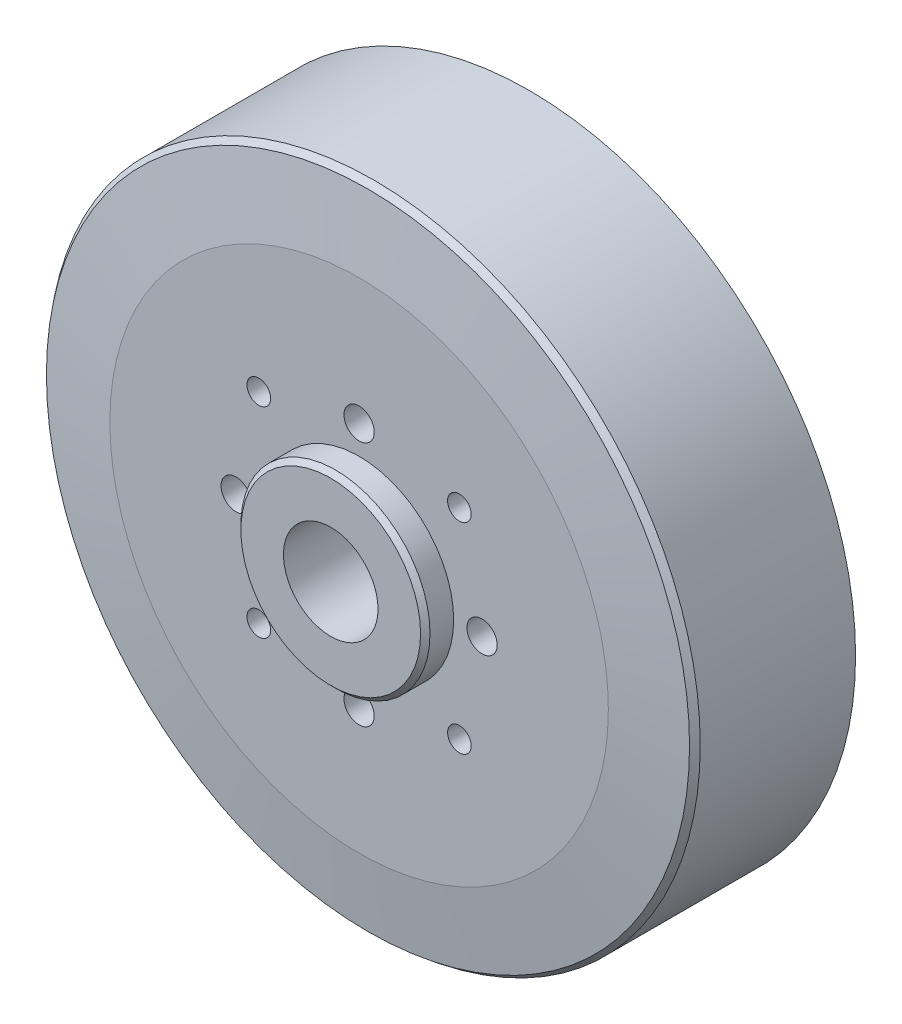
ISO-10303-21;
HEADER;
FILE_DESCRIPTION(('STEP AP214'),'2;1');
FILE_NAME('part.step','',(''),(''),'','','');
FILE_SCHEMA(('AUTOMOTIVE_DESIGN { 1 0 10303 214 1 1 1 1 }'));
ENDSEC;
DATA;
#1=APPLICATION_CONTEXT('core data for automotive mechanical design processes');
#2=APPLICATION_PROTOCOL_DEFINITION('international standard','automotive_design',2000,#1);
#3=PRODUCT_CONTEXT('',#1,'mechanical');
#4=PRODUCT('Part','Part','',(#3));
#5=PRODUCT_RELATED_PRODUCT_CATEGORY('part','',(#4));
#6=PRODUCT_DEFINITION_FORMATION('','',#4);
#7=PRODUCT_DEFINITION_CONTEXT('part definition',#1,'design');
#8=PRODUCT_DEFINITION('design','',#6,#7);
#9=PRODUCT_DEFINITION_SHAPE('','',#8);
#10=(LENGTH_UNIT() NAMED_UNIT(*) SI_UNIT(.MILLI.,.METRE.));
#11=(NAMED_UNIT(*) PLANE_ANGLE_UNIT() SI_UNIT($,.RADIAN.));
#12=(NAMED_UNIT(*) SI_UNIT($,.STERADIAN.) SOLID_ANGLE_UNIT());
#13=UNCERTAINTY_MEASURE_WITH_UNIT(LENGTH_MEASURE(1.E-05),#10,'distance_accuracy_value','');
#14=(GEOMETRIC_REPRESENTATION_CONTEXT(3) GLOBAL_UNCERTAINTY_ASSIGNED_CONTEXT((#13)) GLOBAL_UNIT_ASSIGNED_CONTEXT((#10,
#11,#12)) REPRESENTATION_CONTEXT('',''));
#15=CARTESIAN_POINT('',(0.,0.,0.));
#16=DIRECTION('',(0.,0.,1.));
#17=DIRECTION('',(1.,0.,0.));
#18=AXIS2_PLACEMENT_3D('',#15,#16,#17);
#19=CARTESIAN_POINT('',(0.,0.,-14.1421356237309));
#20=DIRECTION('',(0.,0.,1.));
#21=DIRECTION('',(1.,0.,0.));
#22=AXIS2_PLACEMENT_3D('',#19,#20,#21);
#23=CYLINDRICAL_SURFACE('',#22,5.);
#24=CARTESIAN_POINT('',(0.,0.,21.));
#25=DIRECTION('',(0.,0.,1.));
#26=DIRECTION('',(1.,0.,0.));
#27=AXIS2_PLACEMENT_3D('',#24,#25,#26);
#28=CIRCLE('',#27,5.);
#29=CARTESIAN_POINT('',(5.,0.,21.));
#30=VERTEX_POINT('',#29);
#31=EDGE_CURVE('E113',#30,#30,#28,.T.);
#32=ORIENTED_EDGE('',*,*,#31,.T.);
#33=EDGE_LOOP('',(#32));
#34=FACE_BOUND('',#33,.T.);
#35=CARTESIAN_POINT('',(0.,0.,11.));
#36=DIRECTION('',(0.,0.,-1.));
#37=DIRECTION('',(-1.,0.,0.));
#38=AXIS2_PLACEMENT_3D('',#35,#36,#37);
#39=CIRCLE('',#38,5.);
#40=CARTESIAN_POINT('',(-5.,0.,11.));
#41=VERTEX_POINT('',#40);
#42=EDGE_CURVE('E109',#41,#41,#39,.F.);
#43=ORIENTED_EDGE('',*,*,#42,.F.);
#44=EDGE_LOOP('',(#43));
#45=FACE_BOUND('',#44,.T.);
#46=ADVANCED_FACE('F43',(#34,#45),#23,.F.);
#47=CARTESIAN_POINT('',(0.,0.,18.));
#48=DIRECTION('',(0.,0.,-1.));
#49=DIRECTION('',(-1.,0.,0.));
#50=AXIS2_PLACEMENT_3D('',#47,#48,#49);
#51=CYLINDRICAL_SURFACE('',#50,34.5);
#52=CARTESIAN_POINT('',(0.,0.,16.4257341010232));
#53=DIRECTION('',(0.,0.,1.));
#54=DIRECTION('',(1.,0.,0.));
#55=AXIS2_PLACEMENT_3D('',#52,#53,#54);
#56=CIRCLE('',#55,34.5);
#57=CARTESIAN_POINT('',(34.5,0.,16.4257341010232));
#58=VERTEX_POINT('',#57);
#59=EDGE_CURVE('E61',#58,#58,#56,.F.);
#60=ORIENTED_EDGE('',*,*,#59,.T.);
#61=EDGE_LOOP('',(#60));
#62=FACE_BOUND('',#61,.T.);
#63=CARTESIAN_POINT('',(0.,0.,0.));
#64=DIRECTION('',(0.,0.,1.));
#65=DIRECTION('',(1.,0.,0.));
#66=AXIS2_PLACEMENT_3D('',#63,#64,#65);
#67=CIRCLE('',#66,34.5);
#68=CARTESIAN_POINT('',(34.5,0.,0.));
#69=VERTEX_POINT('',#68);
#70=EDGE_CURVE('E119',#69,#69,#67,.T.);
#71=ORIENTED_EDGE('',*,*,#70,.T.);
#72=EDGE_LOOP('',(#71));
#73=FACE_BOUND('',#72,.T.);
#74=ADVANCED_FACE('F230',(#62,#73),#51,.T.);
#75=CARTESIAN_POINT('',(0.,0.,18.));
#76=DIRECTION('',(0.,0.,1.));
#77=DIRECTION('',(1.,0.,0.));
#78=AXIS2_PLACEMENT_3D('',#75,#76,#77);
#79=PLANE('',#78);
#80=CARTESIAN_POINT('',(13.,0.,18.));
#81=DIRECTION('',(0.,0.,1.));
#82=DIRECTION('',(1.,0.,0.));
#83=AXIS2_PLACEMENT_3D('',#80,#81,#82);
#84=CIRCLE('',#83,1.59999999999999);
#85=CARTESIAN_POINT('',(14.6,0.,18.));
#86=VERTEX_POINT('',#85);
#87=EDGE_CURVE('E73',#86,#86,#84,.T.);
#88=ORIENTED_EDGE('',*,*,#87,.F.);
#89=EDGE_LOOP('',(#88));
#90=FACE_BOUND('',#89,.T.);
#91=CARTESIAN_POINT('',(-13.,0.,18.));
#92=DIRECTION('',(0.,0.,1.));
#93=DIRECTION('',(1.,0.,0.));
#94=AXIS2_PLACEMENT_3D('',#91,#92,#93);
#95=CIRCLE('',#94,1.59999999999999);
#96=CARTESIAN_POINT('',(-11.4,0.,18.));
#97=VERTEX_POINT('',#96);
#98=EDGE_CURVE('E72',#97,#97,#95,.T.);
#99=ORIENTED_EDGE('',*,*,#98,.F.);
#100=EDGE_LOOP('',(#99));
#101=FACE_BOUND('',#100,.T.);
#102=CARTESIAN_POINT('',(0.,13.,18.));
#103=DIRECTION('',(0.,0.,1.));
#104=DIRECTION('',(1.,0.,0.));
#105=AXIS2_PLACEMENT_3D('',#102,#103,#104);
#106=CIRCLE('',#105,1.59999999999999);
#107=CARTESIAN_POINT('',(1.59999999999999,13.,18.));
#108=VERTEX_POINT('',#107);
#109=EDGE_CURVE('E78',#108,#108,#106,.T.);
#110=ORIENTED_EDGE('',*,*,#109,.F.);
#111=EDGE_LOOP('',(#110));
#112=FACE_BOUND('',#111,.T.);
#113=CARTESIAN_POINT('',(0.,-13.,18.));
#114=DIRECTION('',(0.,0.,1.));
#115=DIRECTION('',(1.,0.,0.));
#116=AXIS2_PLACEMENT_3D('',#113,#114,#115);
#117=CIRCLE('',#116,1.59999999999999);
#118=CARTESIAN_POINT('',(1.59999999999997,-13.,18.));
#119=VERTEX_POINT('',#118);
#120=EDGE_CURVE('E83',#119,#119,#117,.T.);
#121=ORIENTED_EDGE('',*,*,#120,.F.);
#122=EDGE_LOOP('',(#121));
#123=FACE_BOUND('',#122,.T.);
#124=CARTESIAN_POINT('',(10.6066017177982,10.6066017177982,18.));
#125=DIRECTION('',(0.,0.,1.));
#126=DIRECTION('',(1.,0.,0.));
#127=AXIS2_PLACEMENT_3D('',#124,#125,#126);
#128=CIRCLE('',#127,1.25);
#129=CARTESIAN_POINT('',(11.8566017177982,10.6066017177982,18.));
#130=VERTEX_POINT('',#129);
#131=EDGE_CURVE('E88',#130,#130,#128,.T.);
#132=ORIENTED_EDGE('',*,*,#131,.F.);
#133=EDGE_LOOP('',(#132));
#134=FACE_BOUND('',#133,.T.);
#135=CARTESIAN_POINT('',(10.6066017177982,-10.6066017177982,18.));
#136=DIRECTION('',(0.,0.,1.));
#137=DIRECTION('',(1.,0.,0.));
#138=AXIS2_PLACEMENT_3D('',#135,#136,#137);
#139=CIRCLE('',#138,1.25);
#140=CARTESIAN_POINT('',(11.8566017177982,-10.6066017177982,18.));
#141=VERTEX_POINT('',#140);
#142=EDGE_CURVE('E93',#141,#141,#139,.T.);
#143=ORIENTED_EDGE('',*,*,#142,.F.);
#144=EDGE_LOOP('',(#143));
#145=FACE_BOUND('',#144,.T.);
#146=CARTESIAN_POINT('',(-10.6066017177982,-10.6066017177982,18.));
#147=DIRECTION('',(0.,0.,1.));
#148=DIRECTION('',(1.,0.,0.));
#149=AXIS2_PLACEMENT_3D('',#146,#147,#148);
#150=CIRCLE('',#149,1.25);
#151=CARTESIAN_POINT('',(-9.35660171779823,-10.6066017177982,18.));
#152=VERTEX_POINT('',#151);
#153=EDGE_CURVE('E98',#152,#152,#150,.T.);
#154=ORIENTED_EDGE('',*,*,#153,.F.);
#155=EDGE_LOOP('',(#154));
#156=FACE_BOUND('',#155,.T.);
#157=CARTESIAN_POINT('',(-10.6066017177982,10.6066017177982,18.));
#158=DIRECTION('',(0.,0.,1.));
#159=DIRECTION('',(1.,0.,0.));
#160=AXIS2_PLACEMENT_3D('',#157,#158,#159);
#161=CIRCLE('',#160,1.25);
#162=CARTESIAN_POINT('',(-9.35660171779821,10.6066017177982,18.));
#163=VERTEX_POINT('',#162);
#164=EDGE_CURVE('E103',#163,#163,#161,.T.);
#165=ORIENTED_EDGE('',*,*,#164,.F.);
#166=EDGE_LOOP('',(#165));
#167=FACE_BOUND('',#166,.T.);
#168=CARTESIAN_POINT('',(0.,0.,18.));
#169=DIRECTION('',(0.,0.,1.));
#170=DIRECTION('',(1.,0.,0.));
#171=AXIS2_PLACEMENT_3D('',#168,#169,#170);
#172=CIRCLE('',#171,26.3556535720257);
#173=CARTESIAN_POINT('',(26.3556535720257,0.,18.));
#174=VERTEX_POINT('',#173);
#175=EDGE_CURVE('E67',#174,#174,#172,.T.);
#176=ORIENTED_EDGE('',*,*,#175,.T.);
#177=EDGE_LOOP('',(#176));
#178=FACE_BOUND('',#177,.T.);
#179=CARTESIAN_POINT('',(0.,0.,18.));
#180=DIRECTION('',(0.,0.,1.));
#181=DIRECTION('',(1.,0.,0.));
#182=AXIS2_PLACEMENT_3D('',#179,#180,#181);
#183=CIRCLE('',#182,10.);
#184=CARTESIAN_POINT('',(10.,0.,18.));
#185=VERTEX_POINT('',#184);
#186=EDGE_CURVE('E118',#185,#185,#183,.T.);
#187=ORIENTED_EDGE('',*,*,#186,.F.);
#188=EDGE_LOOP('',(#187));
#189=FACE_BOUND('',#188,.T.);
#190=ADVANCED_FACE('F226',(#90,#101,#112,#123,#134,#145,#156,#167,#178,#189),#79,.T.);
#191=CARTESIAN_POINT('',(0.,0.,0.));
#192=DIRECTION('',(0.,0.,1.));
#193=DIRECTION('',(1.,0.,0.));
#194=AXIS2_PLACEMENT_3D('',#191,#192,#193);
#195=PLANE('',#194);
#196=CARTESIAN_POINT('',(0.,0.,0.));
#197=DIRECTION('',(0.,0.,-1.));
#198=DIRECTION('',(-1.,0.,0.));
#199=AXIS2_PLACEMENT_3D('',#196,#197,#198);
#200=CIRCLE('',#199,30.);
#201=CARTESIAN_POINT('',(-30.,0.,0.));
#202=VERTEX_POINT('',#201);
#203=EDGE_CURVE('E108',#202,#202,#200,.T.);
#204=ORIENTED_EDGE('',*,*,#203,.F.);
#205=EDGE_LOOP('',(#204));
#206=FACE_BOUND('',#205,.T.);
#207=ORIENTED_EDGE('',*,*,#70,.F.);
#208=EDGE_LOOP('',(#207));
#209=FACE_BOUND('',#208,.T.);
#210=ADVANCED_FACE('F222',(#206,#209),#195,.F.);
#211=CARTESIAN_POINT('',(0.,0.,21.));
#212=DIRECTION('',(0.,0.,-1.));
#213=DIRECTION('',(-1.,0.,0.));
#214=AXIS2_PLACEMENT_3D('',#211,#212,#213);
#215=CYLINDRICAL_SURFACE('',#214,10.);
#216=CARTESIAN_POINT('',(0.,0.,20.5));
#217=DIRECTION('',(0.,0.,1.));
#218=DIRECTION('',(1.,0.,0.));
#219=AXIS2_PLACEMENT_3D('',#216,#217,#218);
#220=CIRCLE('',#219,10.);
#221=CARTESIAN_POINT('',(10.,0.,20.5));
#222=VERTEX_POINT('',#221);
#223=EDGE_CURVE('E11',#222,#222,#220,.F.);
#224=ORIENTED_EDGE('',*,*,#223,.T.);
#225=EDGE_LOOP('',(#224));
#226=FACE_BOUND('',#225,.T.);
#227=ORIENTED_EDGE('',*,*,#186,.T.);
#228=EDGE_LOOP('',(#227));
#229=FACE_BOUND('',#228,.T.);
#230=ADVANCED_FACE('F225',(#226,#229),#215,.T.);
#231=CARTESIAN_POINT('',(0.,0.,21.));
#232=DIRECTION('',(0.,0.,1.));
#233=DIRECTION('',(1.,0.,0.));
#234=AXIS2_PLACEMENT_3D('',#231,#232,#233);
#235=PLANE('',#234);
#236=CARTESIAN_POINT('',(0.,0.,21.));
#237=DIRECTION('',(0.,0.,1.));
#238=DIRECTION('',(1.,0.,0.));
#239=AXIS2_PLACEMENT_3D('',#236,#237,#238);
#240=CIRCLE('',#239,9.50000000000001);
#241=CARTESIAN_POINT('',(9.50000000000001,0.,21.));
#242=VERTEX_POINT('',#241);
#243=EDGE_CURVE('E51',#242,#242,#240,.T.);
#244=ORIENTED_EDGE('',*,*,#243,.T.);
#245=EDGE_LOOP('',(#244));
#246=FACE_BOUND('',#245,.T.);
#247=ORIENTED_EDGE('',*,*,#31,.F.);
#248=EDGE_LOOP('',(#247));
#249=FACE_BOUND('',#248,.T.);
#250=ADVANCED_FACE('F244',(#246,#249),#235,.T.);
#251=CARTESIAN_POINT('',(0.,0.,18.));
#252=DIRECTION('',(0.,0.,-1.));
#253=DIRECTION('',(-1.,0.,0.));
#254=AXIS2_PLACEMENT_3D('',#251,#252,#253);
#255=CONICAL_SURFACE('',#254,26.3556535720257,1.44862327915529);
#256=CARTESIAN_POINT('',(0.,0.,17.0609346717026));
#257=DIRECTION('',(0.,0.,-1.));
#258=DIRECTION('',(-1.,0.,0.));
#259=AXIS2_PLACEMENT_3D('',#256,#257,#258);
#260=CIRCLE('',#259,34.0037269241793);
#261=CARTESIAN_POINT('',(-34.0037269241793,0.,17.0609346717026));
#262=VERTEX_POINT('',#261);
#263=EDGE_CURVE('E56',#262,#262,#260,.F.);
#264=ORIENTED_EDGE('',*,*,#263,.T.);
#265=EDGE_LOOP('',(#264));
#266=FACE_BOUND('',#265,.T.);
#267=ORIENTED_EDGE('',*,*,#175,.F.);
#268=EDGE_LOOP('',(#267));
#269=FACE_BOUND('',#268,.T.);
#270=ADVANCED_FACE('F196',(#266,#269),#255,.T.);
#271=CARTESIAN_POINT('',(0.,0.,11.));
#272=DIRECTION('',(0.,0.,-1.));
#273=DIRECTION('',(-1.,0.,0.));
#274=AXIS2_PLACEMENT_3D('',#271,#272,#273);
#275=PLANE('',#274);
#276=CARTESIAN_POINT('',(0.,0.,11.));
#277=DIRECTION('',(0.,0.,-1.));
#278=DIRECTION('',(-1.,0.,0.));
#279=AXIS2_PLACEMENT_3D('',#276,#277,#278);
#280=CIRCLE('',#279,8.5);
#281=CARTESIAN_POINT('',(-8.5,0.,11.));
#282=VERTEX_POINT('',#281);
#283=EDGE_CURVE('E163',#282,#282,#280,.T.);
#284=ORIENTED_EDGE('',*,*,#283,.F.);
#285=EDGE_LOOP('',(#284));
#286=FACE_BOUND('',#285,.T.);
#287=CARTESIAN_POINT('',(13.,0.,11.));
#288=DIRECTION('',(0.,0.,-1.));
#289=DIRECTION('',(-1.,0.,0.));
#290=AXIS2_PLACEMENT_3D('',#287,#288,#289);
#291=CIRCLE('',#290,1.59999999999999);
#292=CARTESIAN_POINT('',(11.4,0.,11.));
#293=VERTEX_POINT('',#292);
#294=EDGE_CURVE('E68',#293,#293,#291,.T.);
#295=ORIENTED_EDGE('',*,*,#294,.F.);
#296=EDGE_LOOP('',(#295));
#297=FACE_BOUND('',#296,.T.);
#298=CARTESIAN_POINT('',(-13.,0.,11.));
#299=DIRECTION('',(0.,0.,-1.));
#300=DIRECTION('',(-1.,0.,0.));
#301=AXIS2_PLACEMENT_3D('',#298,#299,#300);
#302=CIRCLE('',#301,1.59999999999999);
#303=CARTESIAN_POINT('',(-14.6,0.,11.));
#304=VERTEX_POINT('',#303);
#305=EDGE_CURVE('E74',#304,#304,#302,.T.);
#306=ORIENTED_EDGE('',*,*,#305,.F.);
#307=EDGE_LOOP('',(#306));
#308=FACE_BOUND('',#307,.T.);
#309=CARTESIAN_POINT('',(0.,13.,11.));
#310=DIRECTION('',(0.,0.,-1.));
#311=DIRECTION('',(-1.,0.,0.));
#312=AXIS2_PLACEMENT_3D('',#309,#310,#311);
#313=CIRCLE('',#312,1.59999999999999);
#314=CARTESIAN_POINT('',(-1.59999999999999,13.,11.));
#315=VERTEX_POINT('',#314);
#316=EDGE_CURVE('E79',#315,#315,#313,.T.);
#317=ORIENTED_EDGE('',*,*,#316,.F.);
#318=EDGE_LOOP('',(#317));
#319=FACE_BOUND('',#318,.T.);
#320=CARTESIAN_POINT('',(0.,-13.,11.));
#321=DIRECTION('',(0.,0.,-1.));
#322=DIRECTION('',(-1.,0.,0.));
#323=AXIS2_PLACEMENT_3D('',#320,#321,#322);
#324=CIRCLE('',#323,1.59999999999999);
#325=CARTESIAN_POINT('',(-1.60000000000001,-13.,11.));
#326=VERTEX_POINT('',#325);
#327=EDGE_CURVE('E84',#326,#326,#324,.T.);
#328=ORIENTED_EDGE('',*,*,#327,.F.);
#329=EDGE_LOOP('',(#328));
#330=FACE_BOUND('',#329,.T.);
#331=CARTESIAN_POINT('',(10.6066017177982,10.6066017177982,11.));
#332=DIRECTION('',(0.,0.,-1.));
#333=DIRECTION('',(-1.,0.,0.));
#334=AXIS2_PLACEMENT_3D('',#331,#332,#333);
#335=CIRCLE('',#334,1.25);
#336=CARTESIAN_POINT('',(9.35660171779821,10.6066017177982,11.));
#337=VERTEX_POINT('',#336);
#338=EDGE_CURVE('E89',#337,#337,#335,.T.);
#339=ORIENTED_EDGE('',*,*,#338,.F.);
#340=EDGE_LOOP('',(#339));
#341=FACE_BOUND('',#340,.T.);
#342=CARTESIAN_POINT('',(10.6066017177982,-10.6066017177982,11.));
#343=DIRECTION('',(0.,0.,-1.));
#344=DIRECTION('',(-1.,0.,0.));
#345=AXIS2_PLACEMENT_3D('',#342,#343,#344);
#346=CIRCLE('',#345,1.25);
#347=CARTESIAN_POINT('',(9.35660171779823,-10.6066017177982,11.));
#348=VERTEX_POINT('',#347);
#349=EDGE_CURVE('E94',#348,#348,#346,.T.);
#350=ORIENTED_EDGE('',*,*,#349,.F.);
#351=EDGE_LOOP('',(#350));
#352=FACE_BOUND('',#351,.T.);
#353=CARTESIAN_POINT('',(-10.6066017177982,-10.6066017177982,11.));
#354=DIRECTION('',(0.,0.,-1.));
#355=DIRECTION('',(-1.,0.,0.));
#356=AXIS2_PLACEMENT_3D('',#353,#354,#355);
#357=CIRCLE('',#356,1.25);
#358=CARTESIAN_POINT('',(-11.8566017177982,-10.6066017177982,11.));
#359=VERTEX_POINT('',#358);
#360=EDGE_CURVE('E99',#359,#359,#357,.T.);
#361=ORIENTED_EDGE('',*,*,#360,.F.);
#362=EDGE_LOOP('',(#361));
#363=FACE_BOUND('',#362,.T.);
#364=CARTESIAN_POINT('',(-10.6066017177982,10.6066017177982,11.));
#365=DIRECTION('',(0.,0.,-1.));
#366=DIRECTION('',(-1.,0.,0.));
#367=AXIS2_PLACEMENT_3D('',#364,#365,#366);
#368=CIRCLE('',#367,1.25);
#369=CARTESIAN_POINT('',(-11.8566017177982,10.6066017177982,11.));
#370=VERTEX_POINT('',#369);
#371=EDGE_CURVE('E104',#370,#370,#368,.T.);
#372=ORIENTED_EDGE('',*,*,#371,.F.);
#373=EDGE_LOOP('',(#372));
#374=FACE_BOUND('',#373,.T.);
#375=CARTESIAN_POINT('',(0.,0.,11.));
#376=DIRECTION('',(0.,0.,-1.));
#377=DIRECTION('',(-1.,0.,0.));
#378=AXIS2_PLACEMENT_3D('',#375,#376,#377);
#379=CIRCLE('',#378,30.);
#380=CARTESIAN_POINT('',(-30.,0.,11.));
#381=VERTEX_POINT('',#380);
#382=EDGE_CURVE('E114',#381,#381,#379,.T.);
#383=ORIENTED_EDGE('',*,*,#382,.T.);
#384=EDGE_LOOP('',(#383));
#385=FACE_BOUND('',#384,.T.);
#386=ADVANCED_FACE('F192',(#286,#297,#308,#319,#330,#341,#352,#363,#374,#385),#275,.T.);
#387=CARTESIAN_POINT('',(0.,0.,11.));
#388=DIRECTION('',(0.,0.,-1.));
#389=DIRECTION('',(-1.,0.,0.));
#390=AXIS2_PLACEMENT_3D('',#387,#388,#389);
#391=CYLINDRICAL_SURFACE('',#390,30.);
#392=ORIENTED_EDGE('',*,*,#382,.F.);
#393=EDGE_LOOP('',(#392));
#394=FACE_BOUND('',#393,.T.);
#395=ORIENTED_EDGE('',*,*,#203,.T.);
#396=EDGE_LOOP('',(#395));
#397=FACE_BOUND('',#396,.T.);
#398=ADVANCED_FACE('F195',(#394,#397),#391,.F.);
#399=CARTESIAN_POINT('',(-10.6066017177982,10.6066017177982,18.));
#400=DIRECTION('',(0.,0.,1.));
#401=DIRECTION('',(1.,0.,0.));
#402=AXIS2_PLACEMENT_3D('',#399,#400,#401);
#403=CYLINDRICAL_SURFACE('',#402,1.25);
#404=ORIENTED_EDGE('',*,*,#371,.T.);
#405=EDGE_LOOP('',(#404));
#406=FACE_BOUND('',#405,.T.);
#407=ORIENTED_EDGE('',*,*,#164,.T.);
#408=EDGE_LOOP('',(#407));
#409=FACE_BOUND('',#408,.T.);
#410=ADVANCED_FACE('F218',(#406,#409),#403,.F.);
#411=CARTESIAN_POINT('',(-10.6066017177982,-10.6066017177982,18.));
#412=DIRECTION('',(0.,0.,1.));
#413=DIRECTION('',(1.,0.,0.));
#414=AXIS2_PLACEMENT_3D('',#411,#412,#413);
#415=CYLINDRICAL_SURFACE('',#414,1.25);
#416=ORIENTED_EDGE('',*,*,#360,.T.);
#417=EDGE_LOOP('',(#416));
#418=FACE_BOUND('',#417,.T.);
#419=ORIENTED_EDGE('',*,*,#153,.T.);
#420=EDGE_LOOP('',(#419));
#421=FACE_BOUND('',#420,.T.);
#422=ADVANCED_FACE('F276',(#418,#421),#415,.F.);
#423=CARTESIAN_POINT('',(10.6066017177982,-10.6066017177982,18.));
#424=DIRECTION('',(0.,0.,1.));
#425=DIRECTION('',(1.,0.,0.));
#426=AXIS2_PLACEMENT_3D('',#423,#424,#425);
#427=CYLINDRICAL_SURFACE('',#426,1.25);
#428=ORIENTED_EDGE('',*,*,#349,.T.);
#429=EDGE_LOOP('',(#428));
#430=FACE_BOUND('',#429,.T.);
#431=ORIENTED_EDGE('',*,*,#142,.T.);
#432=EDGE_LOOP('',(#431));
#433=FACE_BOUND('',#432,.T.);
#434=ADVANCED_FACE('F280',(#430,#433),#427,.F.);
#435=CARTESIAN_POINT('',(10.6066017177982,10.6066017177982,18.));
#436=DIRECTION('',(0.,0.,1.));
#437=DIRECTION('',(1.,0.,0.));
#438=AXIS2_PLACEMENT_3D('',#435,#436,#437);
#439=CYLINDRICAL_SURFACE('',#438,1.25);
#440=ORIENTED_EDGE('',*,*,#338,.T.);
#441=EDGE_LOOP('',(#440));
#442=FACE_BOUND('',#441,.T.);
#443=ORIENTED_EDGE('',*,*,#131,.T.);
#444=EDGE_LOOP('',(#443));
#445=FACE_BOUND('',#444,.T.);
#446=ADVANCED_FACE('F284',(#442,#445),#439,.F.);
#447=CARTESIAN_POINT('',(0.,-13.,18.));
#448=DIRECTION('',(0.,0.,1.));
#449=DIRECTION('',(1.,0.,0.));
#450=AXIS2_PLACEMENT_3D('',#447,#448,#449);
#451=CYLINDRICAL_SURFACE('',#450,1.59999999999999);
#452=ORIENTED_EDGE('',*,*,#327,.T.);
#453=EDGE_LOOP('',(#452));
#454=FACE_BOUND('',#453,.T.);
#455=ORIENTED_EDGE('',*,*,#120,.T.);
#456=EDGE_LOOP('',(#455));
#457=FACE_BOUND('',#456,.T.);
#458=ADVANCED_FACE('F288',(#454,#457),#451,.F.);
#459=CARTESIAN_POINT('',(0.,13.,18.));
#460=DIRECTION('',(0.,0.,1.));
#461=DIRECTION('',(1.,0.,0.));
#462=AXIS2_PLACEMENT_3D('',#459,#460,#461);
#463=CYLINDRICAL_SURFACE('',#462,1.59999999999999);
#464=ORIENTED_EDGE('',*,*,#316,.T.);
#465=EDGE_LOOP('',(#464));
#466=FACE_BOUND('',#465,.T.);
#467=ORIENTED_EDGE('',*,*,#109,.T.);
#468=EDGE_LOOP('',(#467));
#469=FACE_BOUND('',#468,.T.);
#470=ADVANCED_FACE('F292',(#466,#469),#463,.F.);
#471=CARTESIAN_POINT('',(-13.,0.,18.));
#472=DIRECTION('',(0.,0.,1.));
#473=DIRECTION('',(1.,0.,0.));
#474=AXIS2_PLACEMENT_3D('',#471,#472,#473);
#475=CYLINDRICAL_SURFACE('',#474,1.59999999999999);
#476=ORIENTED_EDGE('',*,*,#305,.T.);
#477=EDGE_LOOP('',(#476));
#478=FACE_BOUND('',#477,.T.);
#479=ORIENTED_EDGE('',*,*,#98,.T.);
#480=EDGE_LOOP('',(#479));
#481=FACE_BOUND('',#480,.T.);
#482=ADVANCED_FACE('F255',(#478,#481),#475,.F.);
#483=CARTESIAN_POINT('',(13.,0.,18.));
#484=DIRECTION('',(0.,0.,1.));
#485=DIRECTION('',(1.,0.,0.));
#486=AXIS2_PLACEMENT_3D('',#483,#484,#485);
#487=CYLINDRICAL_SURFACE('',#486,1.59999999999999);
#488=ORIENTED_EDGE('',*,*,#294,.T.);
#489=EDGE_LOOP('',(#488));
#490=FACE_BOUND('',#489,.T.);
#491=ORIENTED_EDGE('',*,*,#87,.T.);
#492=EDGE_LOOP('',(#491));
#493=FACE_BOUND('',#492,.T.);
#494=ADVANCED_FACE('F248',(#490,#493),#487,.F.);
#495=CARTESIAN_POINT('',(0.,0.,16.4257341010232));
#496=DIRECTION('',(0.,0.,-1.));
#497=DIRECTION('',(-1.,0.,0.));
#498=AXIS2_PLACEMENT_3D('',#495,#496,#497);
#499=CONICAL_SURFACE('',#498,34.5,0.663225115757849);
#500=ORIENTED_EDGE('',*,*,#263,.F.);
#501=EDGE_LOOP('',(#500));
#502=FACE_BOUND('',#501,.T.);
#503=ORIENTED_EDGE('',*,*,#59,.F.);
#504=EDGE_LOOP('',(#503));
#505=FACE_BOUND('',#504,.T.);
#506=ADVANCED_FACE('F246',(#502,#505),#499,.T.);
#507=CARTESIAN_POINT('',(0.,0.,21.));
#508=DIRECTION('',(0.,0.,-1.));
#509=DIRECTION('',(-1.,0.,0.));
#510=AXIS2_PLACEMENT_3D('',#507,#508,#509);
#511=CONICAL_SURFACE('',#510,9.50000000000001,0.78539816339744);
#512=ORIENTED_EDGE('',*,*,#223,.F.);
#513=EDGE_LOOP('',(#512));
#514=FACE_BOUND('',#513,.T.);
#515=ORIENTED_EDGE('',*,*,#243,.F.);
#516=EDGE_LOOP('',(#515));
#517=FACE_BOUND('',#516,.T.);
#518=ADVANCED_FACE('F45',(#514,#517),#511,.T.);
#519=CARTESIAN_POINT('',(0.,0.,-4.));
#520=DIRECTION('',(0.,0.,1.));
#521=DIRECTION('',(1.,0.,0.));
#522=AXIS2_PLACEMENT_3D('',#519,#520,#521);
#523=PLANE('',#522);
#524=CARTESIAN_POINT('',(0.,0.,-4.));
#525=DIRECTION('',(0.,0.,-1.));
#526=DIRECTION('',(-1.,0.,0.));
#527=AXIS2_PLACEMENT_3D('',#524,#525,#526);
#528=CIRCLE('',#527,3.5);
#529=CARTESIAN_POINT('',(-3.5,0.,-4.));
#530=VERTEX_POINT('',#529);
#531=EDGE_CURVE('E171',#530,#530,#528,.T.);
#532=ORIENTED_EDGE('',*,*,#531,.F.);
#533=EDGE_LOOP('',(#532));
#534=FACE_BOUND('',#533,.T.);
#535=CARTESIAN_POINT('',(0.,0.,-4.));
#536=DIRECTION('',(0.,0.,1.));
#537=DIRECTION('',(1.,0.,0.));
#538=AXIS2_PLACEMENT_3D('',#535,#536,#537);
#539=CIRCLE('',#538,8.5);
#540=CARTESIAN_POINT('',(8.5,0.,-4.));
#541=VERTEX_POINT('',#540);
#542=EDGE_CURVE('E159',#541,#541,#539,.T.);
#543=ORIENTED_EDGE('',*,*,#542,.F.);
#544=EDGE_LOOP('',(#543));
#545=FACE_BOUND('',#544,.T.);
#546=ADVANCED_FACE('F179',(#534,#545),#523,.F.);
#547=CARTESIAN_POINT('',(0.,0.,-53.0416305603426));
#548=DIRECTION('',(0.,0.,1.));
#549=DIRECTION('',(1.,0.,0.));
#550=AXIS2_PLACEMENT_3D('',#547,#548,#549);
#551=CYLINDRICAL_SURFACE('',#550,8.5);
#552=ORIENTED_EDGE('',*,*,#542,.T.);
#553=EDGE_LOOP('',(#552));
#554=FACE_BOUND('',#553,.T.);
#555=ORIENTED_EDGE('',*,*,#283,.T.);
#556=EDGE_LOOP('',(#555));
#557=FACE_BOUND('',#556,.T.);
#558=ADVANCED_FACE('F182',(#554,#557),#551,.T.);
#559=CARTESIAN_POINT('',(0.,0.,11.));
#560=DIRECTION('',(0.,0.,-1.));
#561=DIRECTION('',(-1.,0.,0.));
#562=AXIS2_PLACEMENT_3D('',#559,#560,#561);
#563=PLANE('',#562);
#564=CARTESIAN_POINT('',(0.,0.,11.));
#565=DIRECTION('',(0.,0.,-1.));
#566=DIRECTION('',(-1.,0.,0.));
#567=AXIS2_PLACEMENT_3D('',#564,#565,#566);
#568=CIRCLE('',#567,3.5);
#569=CARTESIAN_POINT('',(-3.5,0.,11.));
#570=VERTEX_POINT('',#569);
#571=EDGE_CURVE('E167',#570,#570,#568,.F.);
#572=ORIENTED_EDGE('',*,*,#571,.F.);
#573=EDGE_LOOP('',(#572));
#574=FACE_BOUND('',#573,.T.);
#575=ORIENTED_EDGE('',*,*,#42,.T.);
#576=EDGE_LOOP('',(#575));
#577=FACE_BOUND('',#576,.T.);
#578=ADVANCED_FACE('F188',(#574,#577),#563,.F.);
#579=CARTESIAN_POINT('',(0.,0.,21.001));
#580=DIRECTION('',(0.,0.,-1.));
#581=DIRECTION('',(-1.,0.,0.));
#582=AXIS2_PLACEMENT_3D('',#579,#580,#581);
#583=CYLINDRICAL_SURFACE('',#582,3.5);
#584=ORIENTED_EDGE('',*,*,#531,.T.);
#585=EDGE_LOOP('',(#584));
#586=FACE_BOUND('',#585,.T.);
#587=ORIENTED_EDGE('',*,*,#571,.T.);
#588=EDGE_LOOP('',(#587));
#589=FACE_BOUND('',#588,.T.);
#590=ADVANCED_FACE('F176',(#586,#589),#583,.F.);
#591=CLOSED_SHELL('',(#46,#74,#190,#210,#230,#250,#270,#386,#398,#410,#422,#434,#446,#458,#470,
#482,#494,#506,#518,#546,#558,#578,#590));
#592=MANIFOLD_SOLID_BREP('B2',#591);
#593=ADVANCED_BREP_SHAPE_REPRESENTATION('',(#18,#592),#14);
#594=SHAPE_DEFINITION_REPRESENTATION(#9,#593);
ENDSEC;
END-ISO-10303-21;
